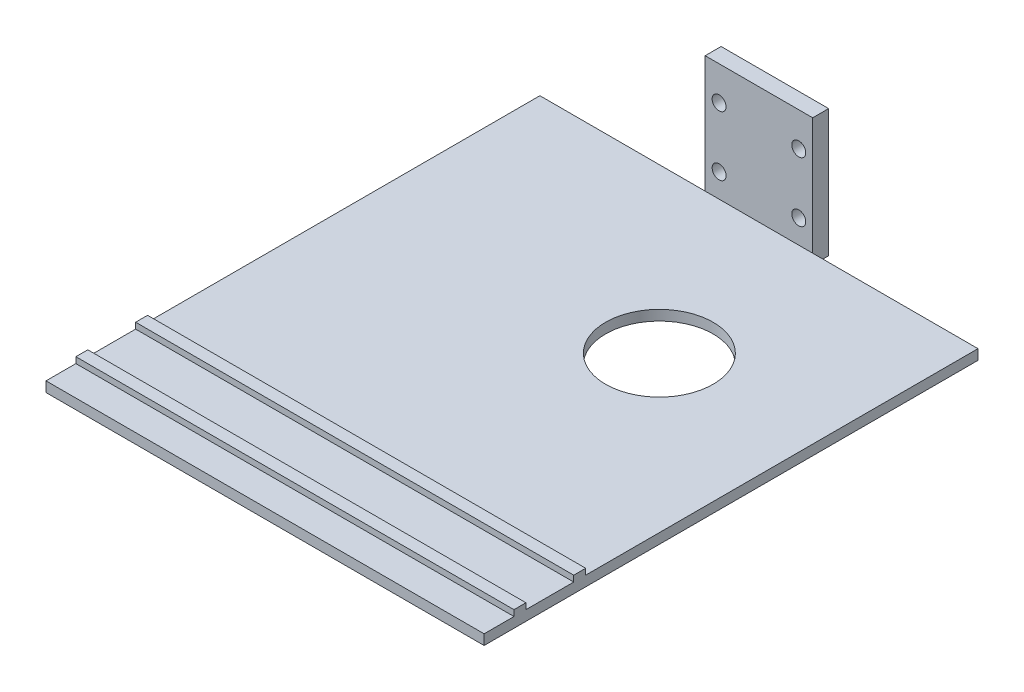
ISO-10303-21;
HEADER;
FILE_DESCRIPTION(('STEP AP214'),'2;1');
FILE_NAME('part.step','',(''),(''),'','','');
FILE_SCHEMA(('AUTOMOTIVE_DESIGN { 1 0 10303 214 1 1 1 1 }'));
ENDSEC;
DATA;
#1=APPLICATION_CONTEXT('core data for automotive mechanical design processes');
#2=APPLICATION_PROTOCOL_DEFINITION('international standard','automotive_design',2000,#1);
#3=PRODUCT_CONTEXT('',#1,'mechanical');
#4=PRODUCT('Part','Part','',(#3));
#5=PRODUCT_RELATED_PRODUCT_CATEGORY('part','',(#4));
#6=PRODUCT_DEFINITION_FORMATION('','',#4);
#7=PRODUCT_DEFINITION_CONTEXT('part definition',#1,'design');
#8=PRODUCT_DEFINITION('design','',#6,#7);
#9=PRODUCT_DEFINITION_SHAPE('','',#8);
#10=(LENGTH_UNIT() NAMED_UNIT(*) SI_UNIT(.MILLI.,.METRE.));
#11=(NAMED_UNIT(*) PLANE_ANGLE_UNIT() SI_UNIT($,.RADIAN.));
#12=(NAMED_UNIT(*) SI_UNIT($,.STERADIAN.) SOLID_ANGLE_UNIT());
#13=UNCERTAINTY_MEASURE_WITH_UNIT(LENGTH_MEASURE(1.E-05),#10,'distance_accuracy_value','');
#14=(GEOMETRIC_REPRESENTATION_CONTEXT(3) GLOBAL_UNCERTAINTY_ASSIGNED_CONTEXT((#13)) GLOBAL_UNIT_ASSIGNED_CONTEXT((#10,
#11,#12)) REPRESENTATION_CONTEXT('',''));
#15=CARTESIAN_POINT('',(0.,0.,0.));
#16=DIRECTION('',(0.,0.,1.));
#17=DIRECTION('',(1.,0.,0.));
#18=AXIS2_PLACEMENT_3D('',#15,#16,#17);
#19=CARTESIAN_POINT('',(-41.5,-33.4507406443201,4.));
#20=DIRECTION('',(0.,1.,0.));
#21=DIRECTION('',(0.,0.,1.));
#22=AXIS2_PLACEMENT_3D('',#19,#20,#21);
#23=PLANE('',#22);
#24=DIRECTION('',(-1.,0.,0.));
#25=VECTOR('',#24,1.);
#26=CARTESIAN_POINT('',(68.5,-33.4507406443201,117.5));
#27=LINE('',#26,#25);
#28=CARTESIAN_POINT('',(68.5,-33.4507406443201,117.5));
#29=VERTEX_POINT('',#28);
#30=CARTESIAN_POINT('',(-41.5,-33.4507406443201,117.5));
#31=VERTEX_POINT('',#30);
#32=EDGE_CURVE('E258',#29,#31,#27,.T.);
#33=ORIENTED_EDGE('',*,*,#32,.F.);
#34=DIRECTION('',(0.,0.,1.));
#35=VECTOR('',#34,1.);
#36=CARTESIAN_POINT('',(68.5,-33.45074064432,4.));
#37=LINE('',#36,#35);
#38=CARTESIAN_POINT('',(68.5,-33.4507406443201,105.5));
#39=VERTEX_POINT('',#38);
#40=EDGE_CURVE('E347',#39,#29,#37,.T.);
#41=ORIENTED_EDGE('',*,*,#40,.F.);
#42=DIRECTION('',(-1.,0.,0.));
#43=VECTOR('',#42,1.);
#44=CARTESIAN_POINT('',(68.5,-33.4507406443201,105.5));
#45=LINE('',#44,#43);
#46=CARTESIAN_POINT('',(-41.5,-33.4507406443201,105.5));
#47=VERTEX_POINT('',#46);
#48=EDGE_CURVE('E336',#39,#47,#45,.T.);
#49=ORIENTED_EDGE('',*,*,#48,.T.);
#50=DIRECTION('',(0.,0.,1.));
#51=VECTOR('',#50,1.);
#52=CARTESIAN_POINT('',(-41.5,-33.4507406443201,4.));
#53=LINE('',#52,#51);
#54=EDGE_CURVE('E269',#47,#31,#53,.T.);
#55=ORIENTED_EDGE('',*,*,#54,.T.);
#56=EDGE_LOOP('',(#33,#41,#49,#55));
#57=FACE_BOUND('',#56,.T.);
#58=ADVANCED_FACE('F33',(#57),#23,.T.);
#59=CARTESIAN_POINT('',(29.5,-33.4507406443201,45.));
#60=DIRECTION('',(0.,1.,0.));
#61=DIRECTION('',(0.,0.,1.));
#62=AXIS2_PLACEMENT_3D('',#59,#60,#61);
#63=CIRCLE('',#62,13.5);
#64=CARTESIAN_POINT('',(29.5,-33.4507406443201,58.5));
#65=VERTEX_POINT('',#64);
#66=EDGE_CURVE('E385',#65,#65,#63,.T.);
#67=ORIENTED_EDGE('',*,*,#66,.F.);
#68=EDGE_LOOP('',(#67));
#69=FACE_BOUND('',#68,.T.);
#70=DIRECTION('',(-1.,0.,0.));
#71=VECTOR('',#70,1.);
#72=CARTESIAN_POINT('',(68.5,-33.4507406443201,102.5));
#73=LINE('',#72,#71);
#74=CARTESIAN_POINT('',(68.5,-33.4507406443201,102.5));
#75=VERTEX_POINT('',#74);
#76=CARTESIAN_POINT('',(-41.5,-33.4507406443201,102.5));
#77=VERTEX_POINT('',#76);
#78=EDGE_CURVE('E339',#75,#77,#73,.T.);
#79=ORIENTED_EDGE('',*,*,#78,.F.);
#80=CARTESIAN_POINT('',(68.5,-33.45074064432,4.));
#81=VERTEX_POINT('',#80);
#82=EDGE_CURVE('E343',#81,#75,#37,.T.);
#83=ORIENTED_EDGE('',*,*,#82,.F.);
#84=DIRECTION('',(1.,0.,0.));
#85=VECTOR('',#84,1.);
#86=CARTESIAN_POINT('',(-41.5,-33.4507406443201,4.));
#87=LINE('',#86,#85);
#88=CARTESIAN_POINT('',(27.,-33.45074064432,4.));
#89=VERTEX_POINT('',#88);
#90=EDGE_CURVE('E45',#89,#81,#87,.T.);
#91=ORIENTED_EDGE('',*,*,#90,.F.);
#92=CARTESIAN_POINT('',(0.,-33.45074064432,4.));
#93=VERTEX_POINT('',#92);
#94=EDGE_CURVE('E11',#93,#89,#87,.T.);
#95=ORIENTED_EDGE('',*,*,#94,.F.);
#96=CARTESIAN_POINT('',(-41.5,-33.4507406443201,4.));
#97=VERTEX_POINT('',#96);
#98=EDGE_CURVE('E44',#97,#93,#87,.T.);
#99=ORIENTED_EDGE('',*,*,#98,.F.);
#100=EDGE_CURVE('E272',#97,#77,#53,.T.);
#101=ORIENTED_EDGE('',*,*,#100,.T.);
#102=EDGE_LOOP('',(#79,#83,#91,#95,#99,#101));
#103=FACE_BOUND('',#102,.T.);
#104=ADVANCED_FACE('F223',(#69,#103),#23,.T.);
#105=CARTESIAN_POINT('',(0.,0.,4.));
#106=DIRECTION('',(0.,0.,1.));
#107=DIRECTION('',(1.,0.,0.));
#108=AXIS2_PLACEMENT_3D('',#105,#106,#107);
#109=PLANE('',#108);
#110=DIRECTION('',(1.,0.,0.));
#111=VECTOR('',#110,1.);
#112=CARTESIAN_POINT('',(0.,-4.,4.));
#113=LINE('',#112,#111);
#114=CARTESIAN_POINT('',(0.,-4.,4.));
#115=VERTEX_POINT('',#114);
#116=CARTESIAN_POINT('',(27.,-4.,4.));
#117=VERTEX_POINT('',#116);
#118=EDGE_CURVE('E163',#115,#117,#113,.T.);
#119=ORIENTED_EDGE('',*,*,#118,.F.);
#120=DIRECTION('',(0.,-1.,0.));
#121=VECTOR('',#120,1.);
#122=CARTESIAN_POINT('',(0.,0.,4.));
#123=LINE('',#122,#121);
#124=EDGE_CURVE('E171',#115,#93,#123,.T.);
#125=ORIENTED_EDGE('',*,*,#124,.T.);
#126=ORIENTED_EDGE('',*,*,#94,.T.);
#127=DIRECTION('',(0.,1.,0.));
#128=VECTOR('',#127,1.);
#129=CARTESIAN_POINT('',(27.,0.,4.));
#130=LINE('',#129,#128);
#131=EDGE_CURVE('E304',#89,#117,#130,.T.);
#132=ORIENTED_EDGE('',*,*,#131,.T.);
#133=EDGE_LOOP('',(#119,#125,#126,#132));
#134=FACE_BOUND('',#133,.T.);
#135=CARTESIAN_POINT('',(23.5,-27.5,4.));
#136=DIRECTION('',(0.,0.,1.));
#137=DIRECTION('',(1.,0.,0.));
#138=AXIS2_PLACEMENT_3D('',#135,#136,#137);
#139=CIRCLE('',#138,1.75);
#140=CARTESIAN_POINT('',(25.25,-27.5,4.));
#141=VERTEX_POINT('',#140);
#142=EDGE_CURVE('E299',#141,#141,#139,.T.);
#143=ORIENTED_EDGE('',*,*,#142,.F.);
#144=EDGE_LOOP('',(#143));
#145=FACE_BOUND('',#144,.T.);
#146=CARTESIAN_POINT('',(3.5,-12.5,4.));
#147=DIRECTION('',(0.,0.,1.));
#148=DIRECTION('',(1.,0.,0.));
#149=AXIS2_PLACEMENT_3D('',#146,#147,#148);
#150=CIRCLE('',#149,1.75);
#151=CARTESIAN_POINT('',(5.25,-12.5,4.));
#152=VERTEX_POINT('',#151);
#153=EDGE_CURVE('E298',#152,#152,#150,.T.);
#154=ORIENTED_EDGE('',*,*,#153,.F.);
#155=EDGE_LOOP('',(#154));
#156=FACE_BOUND('',#155,.T.);
#157=CARTESIAN_POINT('',(3.5,-27.5,4.));
#158=DIRECTION('',(0.,0.,1.));
#159=DIRECTION('',(1.,0.,0.));
#160=AXIS2_PLACEMENT_3D('',#157,#158,#159);
#161=CIRCLE('',#160,1.75);
#162=CARTESIAN_POINT('',(5.25000000000001,-27.5,4.));
#163=VERTEX_POINT('',#162);
#164=EDGE_CURVE('E289',#163,#163,#161,.T.);
#165=ORIENTED_EDGE('',*,*,#164,.F.);
#166=EDGE_LOOP('',(#165));
#167=FACE_BOUND('',#166,.T.);
#168=CARTESIAN_POINT('',(23.5,-12.5,4.));
#169=DIRECTION('',(0.,0.,1.));
#170=DIRECTION('',(1.,0.,0.));
#171=AXIS2_PLACEMENT_3D('',#168,#169,#170);
#172=CIRCLE('',#171,1.75);
#173=CARTESIAN_POINT('',(25.25,-12.5,4.));
#174=VERTEX_POINT('',#173);
#175=EDGE_CURVE('E196',#174,#174,#172,.T.);
#176=ORIENTED_EDGE('',*,*,#175,.F.);
#177=EDGE_LOOP('',(#176));
#178=FACE_BOUND('',#177,.T.);
#179=ADVANCED_FACE('F230',(#134,#145,#156,#167,#178),#109,.T.);
#180=CARTESIAN_POINT('',(0.,0.,4.));
#181=DIRECTION('',(1.,0.,0.));
#182=DIRECTION('',(0.,1.,0.));
#183=AXIS2_PLACEMENT_3D('',#180,#181,#182);
#184=PLANE('',#183);
#185=ORIENTED_EDGE('',*,*,#124,.F.);
#186=DIRECTION('',(0.,0.,1.));
#187=VECTOR('',#186,1.);
#188=CARTESIAN_POINT('',(0.,-4.,0.));
#189=LINE('',#188,#187);
#190=CARTESIAN_POINT('',(0.,-4.,0.));
#191=VERTEX_POINT('',#190);
#192=EDGE_CURVE('E157',#191,#115,#189,.T.);
#193=ORIENTED_EDGE('',*,*,#192,.F.);
#194=DIRECTION('',(0.,-1.,0.));
#195=VECTOR('',#194,1.);
#196=CARTESIAN_POINT('',(0.,0.,0.));
#197=LINE('',#196,#195);
#198=CARTESIAN_POINT('',(0.,-36.,0.));
#199=VERTEX_POINT('',#198);
#200=EDGE_CURVE('E168',#191,#199,#197,.T.);
#201=ORIENTED_EDGE('',*,*,#200,.T.);
#202=DIRECTION('',(0.,0.,-1.));
#203=VECTOR('',#202,1.);
#204=CARTESIAN_POINT('',(0.,-36.,4.));
#205=LINE('',#204,#203);
#206=CARTESIAN_POINT('',(0.,-36.,4.));
#207=VERTEX_POINT('',#206);
#208=EDGE_CURVE('E42',#207,#199,#205,.T.);
#209=ORIENTED_EDGE('',*,*,#208,.F.);
#210=EDGE_CURVE('E187',#93,#207,#123,.T.);
#211=ORIENTED_EDGE('',*,*,#210,.F.);
#212=EDGE_LOOP('',(#185,#193,#201,#209,#211));
#213=FACE_BOUND('',#212,.T.);
#214=ADVANCED_FACE('F35',(#213),#184,.F.);
#215=CARTESIAN_POINT('',(0.,-36.,4.));
#216=DIRECTION('',(0.,1.,0.));
#217=DIRECTION('',(0.,0.,1.));
#218=AXIS2_PLACEMENT_3D('',#215,#216,#217);
#219=PLANE('',#218);
#220=CARTESIAN_POINT('',(29.5,-36.,45.));
#221=DIRECTION('',(0.,1.,0.));
#222=DIRECTION('',(0.,0.,1.));
#223=AXIS2_PLACEMENT_3D('',#220,#221,#222);
#224=CIRCLE('',#223,13.5);
#225=CARTESIAN_POINT('',(29.5,-36.,58.5));
#226=VERTEX_POINT('',#225);
#227=EDGE_CURVE('E37',#226,#226,#224,.T.);
#228=ORIENTED_EDGE('',*,*,#227,.T.);
#229=EDGE_LOOP('',(#228));
#230=FACE_BOUND('',#229,.T.);
#231=DIRECTION('',(1.,0.,0.));
#232=VECTOR('',#231,1.);
#233=CARTESIAN_POINT('',(0.,-36.,0.));
#234=LINE('',#233,#232);
#235=CARTESIAN_POINT('',(27.,-36.,0.));
#236=VERTEX_POINT('',#235);
#237=EDGE_CURVE('E174',#199,#236,#234,.T.);
#238=ORIENTED_EDGE('',*,*,#237,.T.);
#239=DIRECTION('',(0.,0.,-1.));
#240=VECTOR('',#239,1.);
#241=CARTESIAN_POINT('',(27.,-36.,4.));
#242=LINE('',#241,#240);
#243=CARTESIAN_POINT('',(27.,-36.,4.));
#244=VERTEX_POINT('',#243);
#245=EDGE_CURVE('E188',#244,#236,#242,.T.);
#246=ORIENTED_EDGE('',*,*,#245,.F.);
#247=DIRECTION('',(1.,0.,0.));
#248=VECTOR('',#247,1.);
#249=CARTESIAN_POINT('',(-41.5,-36.,4.));
#250=LINE('',#249,#248);
#251=CARTESIAN_POINT('',(68.5,-36.,4.));
#252=VERTEX_POINT('',#251);
#253=EDGE_CURVE('E290',#244,#252,#250,.T.);
#254=ORIENTED_EDGE('',*,*,#253,.T.);
#255=DIRECTION('',(0.,0.,-1.));
#256=VECTOR('',#255,1.);
#257=CARTESIAN_POINT('',(68.5,-36.,4.));
#258=LINE('',#257,#256);
#259=CARTESIAN_POINT('',(68.5,-36.,128.));
#260=VERTEX_POINT('',#259);
#261=EDGE_CURVE('E275',#260,#252,#258,.T.);
#262=ORIENTED_EDGE('',*,*,#261,.F.);
#263=DIRECTION('',(1.,0.,0.));
#264=VECTOR('',#263,1.);
#265=CARTESIAN_POINT('',(-41.5,-36.,128.));
#266=LINE('',#265,#264);
#267=CARTESIAN_POINT('',(-41.5,-36.,128.));
#268=VERTEX_POINT('',#267);
#269=EDGE_CURVE('E291',#268,#260,#266,.T.);
#270=ORIENTED_EDGE('',*,*,#269,.F.);
#271=DIRECTION('',(0.,0.,-1.));
#272=VECTOR('',#271,1.);
#273=CARTESIAN_POINT('',(-41.5,-36.,4.));
#274=LINE('',#273,#272);
#275=CARTESIAN_POINT('',(-41.5,-36.,4.));
#276=VERTEX_POINT('',#275);
#277=EDGE_CURVE('E282',#268,#276,#274,.T.);
#278=ORIENTED_EDGE('',*,*,#277,.T.);
#279=EDGE_CURVE('E286',#276,#207,#250,.T.);
#280=ORIENTED_EDGE('',*,*,#279,.T.);
#281=ORIENTED_EDGE('',*,*,#208,.T.);
#282=EDGE_LOOP('',(#238,#246,#254,#262,#270,#278,#280,#281));
#283=FACE_BOUND('',#282,.T.);
#284=ADVANCED_FACE('F310',(#230,#283),#219,.F.);
#285=CARTESIAN_POINT('',(27.,0.,4.));
#286=DIRECTION('',(-1.,0.,0.));
#287=DIRECTION('',(0.,-1.,0.));
#288=AXIS2_PLACEMENT_3D('',#285,#286,#287);
#289=PLANE('',#288);
#290=DIRECTION('',(0.,1.,0.));
#291=VECTOR('',#290,1.);
#292=CARTESIAN_POINT('',(27.,0.,0.));
#293=LINE('',#292,#291);
#294=CARTESIAN_POINT('',(27.,-4.,0.));
#295=VERTEX_POINT('',#294);
#296=EDGE_CURVE('E178',#236,#295,#293,.T.);
#297=ORIENTED_EDGE('',*,*,#296,.T.);
#298=DIRECTION('',(0.,0.,1.));
#299=VECTOR('',#298,1.);
#300=CARTESIAN_POINT('',(27.,-4.,0.));
#301=LINE('',#300,#299);
#302=EDGE_CURVE('E52',#295,#117,#301,.T.);
#303=ORIENTED_EDGE('',*,*,#302,.T.);
#304=ORIENTED_EDGE('',*,*,#131,.F.);
#305=EDGE_CURVE('E183',#244,#89,#130,.T.);
#306=ORIENTED_EDGE('',*,*,#305,.F.);
#307=ORIENTED_EDGE('',*,*,#245,.T.);
#308=EDGE_LOOP('',(#297,#303,#304,#306,#307));
#309=FACE_BOUND('',#308,.T.);
#310=ADVANCED_FACE('F477',(#309),#289,.F.);
#311=CARTESIAN_POINT('',(0.,0.,0.));
#312=DIRECTION('',(0.,0.,1.));
#313=DIRECTION('',(1.,0.,0.));
#314=AXIS2_PLACEMENT_3D('',#311,#312,#313);
#315=PLANE('',#314);
#316=CARTESIAN_POINT('',(23.5,-27.5,0.));
#317=DIRECTION('',(0.,0.,1.));
#318=DIRECTION('',(1.,0.,0.));
#319=AXIS2_PLACEMENT_3D('',#316,#317,#318);
#320=CIRCLE('',#319,1.75);
#321=CARTESIAN_POINT('',(25.25,-27.5,0.));
#322=VERTEX_POINT('',#321);
#323=EDGE_CURVE('E176',#322,#322,#320,.T.);
#324=ORIENTED_EDGE('',*,*,#323,.T.);
#325=EDGE_LOOP('',(#324));
#326=FACE_BOUND('',#325,.T.);
#327=CARTESIAN_POINT('',(3.5,-12.5,0.));
#328=DIRECTION('',(0.,0.,1.));
#329=DIRECTION('',(1.,0.,0.));
#330=AXIS2_PLACEMENT_3D('',#327,#328,#329);
#331=CIRCLE('',#330,1.75);
#332=CARTESIAN_POINT('',(5.25,-12.5,0.));
#333=VERTEX_POINT('',#332);
#334=EDGE_CURVE('E181',#333,#333,#331,.T.);
#335=ORIENTED_EDGE('',*,*,#334,.T.);
#336=EDGE_LOOP('',(#335));
#337=FACE_BOUND('',#336,.T.);
#338=CARTESIAN_POINT('',(3.5,-27.5,0.));
#339=DIRECTION('',(0.,0.,1.));
#340=DIRECTION('',(1.,0.,0.));
#341=AXIS2_PLACEMENT_3D('',#338,#339,#340);
#342=CIRCLE('',#341,1.75);
#343=CARTESIAN_POINT('',(5.25000000000001,-27.5,0.));
#344=VERTEX_POINT('',#343);
#345=EDGE_CURVE('E195',#344,#344,#342,.T.);
#346=ORIENTED_EDGE('',*,*,#345,.T.);
#347=EDGE_LOOP('',(#346));
#348=FACE_BOUND('',#347,.T.);
#349=CARTESIAN_POINT('',(23.5,-12.5,0.));
#350=DIRECTION('',(0.,0.,1.));
#351=DIRECTION('',(1.,0.,0.));
#352=AXIS2_PLACEMENT_3D('',#349,#350,#351);
#353=CIRCLE('',#352,1.75);
#354=CARTESIAN_POINT('',(25.25,-12.5,0.));
#355=VERTEX_POINT('',#354);
#356=EDGE_CURVE('E192',#355,#355,#353,.T.);
#357=ORIENTED_EDGE('',*,*,#356,.T.);
#358=EDGE_LOOP('',(#357));
#359=FACE_BOUND('',#358,.T.);
#360=ORIENTED_EDGE('',*,*,#200,.F.);
#361=DIRECTION('',(1.,0.,0.));
#362=VECTOR('',#361,1.);
#363=CARTESIAN_POINT('',(0.,-4.,0.));
#364=LINE('',#363,#362);
#365=EDGE_CURVE('E154',#191,#295,#364,.T.);
#366=ORIENTED_EDGE('',*,*,#365,.T.);
#367=ORIENTED_EDGE('',*,*,#296,.F.);
#368=ORIENTED_EDGE('',*,*,#237,.F.);
#369=EDGE_LOOP('',(#360,#366,#367,#368));
#370=FACE_BOUND('',#369,.T.);
#371=ADVANCED_FACE('F173',(#326,#337,#348,#359,#370),#315,.F.);
#372=CARTESIAN_POINT('',(23.5,-12.5,-6.));
#373=DIRECTION('',(0.,0.,1.));
#374=DIRECTION('',(1.,0.,0.));
#375=AXIS2_PLACEMENT_3D('',#372,#373,#374);
#376=CYLINDRICAL_SURFACE('',#375,1.75);
#377=ORIENTED_EDGE('',*,*,#175,.T.);
#378=EDGE_LOOP('',(#377));
#379=FACE_BOUND('',#378,.T.);
#380=ORIENTED_EDGE('',*,*,#356,.F.);
#381=EDGE_LOOP('',(#380));
#382=FACE_BOUND('',#381,.T.);
#383=ADVANCED_FACE('F217',(#379,#382),#376,.F.);
#384=CARTESIAN_POINT('',(3.5,-27.5,-6.));
#385=DIRECTION('',(0.,0.,1.));
#386=DIRECTION('',(1.,0.,0.));
#387=AXIS2_PLACEMENT_3D('',#384,#385,#386);
#388=CYLINDRICAL_SURFACE('',#387,1.75);
#389=ORIENTED_EDGE('',*,*,#164,.T.);
#390=EDGE_LOOP('',(#389));
#391=FACE_BOUND('',#390,.T.);
#392=ORIENTED_EDGE('',*,*,#345,.F.);
#393=EDGE_LOOP('',(#392));
#394=FACE_BOUND('',#393,.T.);
#395=ADVANCED_FACE('F207',(#391,#394),#388,.F.);
#396=CARTESIAN_POINT('',(3.5,-12.5,-6.));
#397=DIRECTION('',(0.,0.,1.));
#398=DIRECTION('',(1.,0.,0.));
#399=AXIS2_PLACEMENT_3D('',#396,#397,#398);
#400=CYLINDRICAL_SURFACE('',#399,1.75);
#401=ORIENTED_EDGE('',*,*,#153,.T.);
#402=EDGE_LOOP('',(#401));
#403=FACE_BOUND('',#402,.T.);
#404=ORIENTED_EDGE('',*,*,#334,.F.);
#405=EDGE_LOOP('',(#404));
#406=FACE_BOUND('',#405,.T.);
#407=ADVANCED_FACE('F204',(#403,#406),#400,.F.);
#408=CARTESIAN_POINT('',(23.5,-27.5,-6.));
#409=DIRECTION('',(0.,0.,1.));
#410=DIRECTION('',(1.,0.,0.));
#411=AXIS2_PLACEMENT_3D('',#408,#409,#410);
#412=CYLINDRICAL_SURFACE('',#411,1.75);
#413=ORIENTED_EDGE('',*,*,#142,.T.);
#414=EDGE_LOOP('',(#413));
#415=FACE_BOUND('',#414,.T.);
#416=ORIENTED_EDGE('',*,*,#323,.F.);
#417=EDGE_LOOP('',(#416));
#418=FACE_BOUND('',#417,.T.);
#419=ADVANCED_FACE('F206',(#415,#418),#412,.F.);
#420=CARTESIAN_POINT('',(-41.5,-36.,4.));
#421=DIRECTION('',(0.,0.,-1.));
#422=DIRECTION('',(-1.,0.,0.));
#423=AXIS2_PLACEMENT_3D('',#420,#421,#422);
#424=PLANE('',#423);
#425=ORIENTED_EDGE('',*,*,#98,.T.);
#426=ORIENTED_EDGE('',*,*,#210,.T.);
#427=ORIENTED_EDGE('',*,*,#279,.F.);
#428=DIRECTION('',(0.,1.,0.));
#429=VECTOR('',#428,1.);
#430=CARTESIAN_POINT('',(-41.5,-36.,4.));
#431=LINE('',#430,#429);
#432=EDGE_CURVE('E270',#276,#97,#431,.T.);
#433=ORIENTED_EDGE('',*,*,#432,.T.);
#434=EDGE_LOOP('',(#425,#426,#427,#433));
#435=FACE_BOUND('',#434,.T.);
#436=ADVANCED_FACE('F214',(#435),#424,.T.);
#437=ORIENTED_EDGE('',*,*,#253,.F.);
#438=ORIENTED_EDGE('',*,*,#305,.T.);
#439=ORIENTED_EDGE('',*,*,#90,.T.);
#440=DIRECTION('',(0.,1.,0.));
#441=VECTOR('',#440,1.);
#442=CARTESIAN_POINT('',(68.5,-36.,4.));
#443=LINE('',#442,#441);
#444=EDGE_CURVE('E333',#252,#81,#443,.T.);
#445=ORIENTED_EDGE('',*,*,#444,.F.);
#446=EDGE_LOOP('',(#437,#438,#439,#445));
#447=FACE_BOUND('',#446,.T.);
#448=ADVANCED_FACE('F246',(#447),#424,.T.);
#449=CARTESIAN_POINT('',(-41.5,-36.,128.));
#450=DIRECTION('',(0.,0.,1.));
#451=DIRECTION('',(1.,0.,0.));
#452=AXIS2_PLACEMENT_3D('',#449,#450,#451);
#453=PLANE('',#452);
#454=ORIENTED_EDGE('',*,*,#269,.T.);
#455=DIRECTION('',(0.,-1.,0.));
#456=VECTOR('',#455,1.);
#457=CARTESIAN_POINT('',(68.5,-36.,128.));
#458=LINE('',#457,#456);
#459=CARTESIAN_POINT('',(68.5,-33.4507406443201,128.));
#460=VERTEX_POINT('',#459);
#461=EDGE_CURVE('E346',#460,#260,#458,.T.);
#462=ORIENTED_EDGE('',*,*,#461,.F.);
#463=DIRECTION('',(1.,0.,0.));
#464=VECTOR('',#463,1.);
#465=CARTESIAN_POINT('',(-41.5,-33.4507406443201,128.));
#466=LINE('',#465,#464);
#467=CARTESIAN_POINT('',(-41.5,-33.4507406443201,128.));
#468=VERTEX_POINT('',#467);
#469=EDGE_CURVE('E293',#468,#460,#466,.T.);
#470=ORIENTED_EDGE('',*,*,#469,.F.);
#471=DIRECTION('',(0.,-1.,0.));
#472=VECTOR('',#471,1.);
#473=CARTESIAN_POINT('',(-41.5,-36.,128.));
#474=LINE('',#473,#472);
#475=EDGE_CURVE('E268',#468,#268,#474,.T.);
#476=ORIENTED_EDGE('',*,*,#475,.T.);
#477=EDGE_LOOP('',(#454,#462,#470,#476));
#478=FACE_BOUND('',#477,.T.);
#479=ADVANCED_FACE('F237',(#478),#453,.T.);
#480=DIRECTION('',(-1.,0.,0.));
#481=VECTOR('',#480,1.);
#482=CARTESIAN_POINT('',(68.5,-33.4507406443201,120.5));
#483=LINE('',#482,#481);
#484=CARTESIAN_POINT('',(68.5,-33.4507406443201,120.5));
#485=VERTEX_POINT('',#484);
#486=CARTESIAN_POINT('',(-41.5,-33.4507406443201,120.5));
#487=VERTEX_POINT('',#486);
#488=EDGE_CURVE('E250',#485,#487,#483,.T.);
#489=ORIENTED_EDGE('',*,*,#488,.T.);
#490=EDGE_CURVE('E253',#487,#468,#53,.T.);
#491=ORIENTED_EDGE('',*,*,#490,.T.);
#492=ORIENTED_EDGE('',*,*,#469,.T.);
#493=EDGE_CURVE('E255',#485,#460,#37,.T.);
#494=ORIENTED_EDGE('',*,*,#493,.F.);
#495=EDGE_LOOP('',(#489,#491,#492,#494));
#496=FACE_BOUND('',#495,.T.);
#497=ADVANCED_FACE('F226',(#496),#23,.T.);
#498=CARTESIAN_POINT('',(-41.5,0.,0.));
#499=DIRECTION('',(1.,0.,0.));
#500=DIRECTION('',(0.,0.,-1.));
#501=AXIS2_PLACEMENT_3D('',#498,#499,#500);
#502=PLANE('',#501);
#503=ORIENTED_EDGE('',*,*,#432,.F.);
#504=ORIENTED_EDGE('',*,*,#277,.F.);
#505=ORIENTED_EDGE('',*,*,#475,.F.);
#506=ORIENTED_EDGE('',*,*,#490,.F.);
#507=DIRECTION('',(0.,1.,0.));
#508=VECTOR('',#507,1.);
#509=CARTESIAN_POINT('',(-41.5,-33.4507406443201,120.5));
#510=LINE('',#509,#508);
#511=CARTESIAN_POINT('',(-41.5,-31.95074064432,120.5));
#512=VERTEX_POINT('',#511);
#513=EDGE_CURVE('E264',#487,#512,#510,.T.);
#514=ORIENTED_EDGE('',*,*,#513,.T.);
#515=DIRECTION('',(0.,0.,-1.));
#516=VECTOR('',#515,1.);
#517=CARTESIAN_POINT('',(-41.5,-31.95074064432,117.5));
#518=LINE('',#517,#516);
#519=CARTESIAN_POINT('',(-41.5,-31.95074064432,117.5));
#520=VERTEX_POINT('',#519);
#521=EDGE_CURVE('E372',#512,#520,#518,.T.);
#522=ORIENTED_EDGE('',*,*,#521,.T.);
#523=DIRECTION('',(0.,-1.,0.));
#524=VECTOR('',#523,1.);
#525=CARTESIAN_POINT('',(-41.5,-33.4507406443201,117.5));
#526=LINE('',#525,#524);
#527=EDGE_CURVE('E376',#520,#31,#526,.T.);
#528=ORIENTED_EDGE('',*,*,#527,.T.);
#529=ORIENTED_EDGE('',*,*,#54,.F.);
#530=DIRECTION('',(0.,1.,0.));
#531=VECTOR('',#530,1.);
#532=CARTESIAN_POINT('',(-41.5,-33.4507406443201,105.5));
#533=LINE('',#532,#531);
#534=CARTESIAN_POINT('',(-41.5,-31.95074064432,105.5));
#535=VERTEX_POINT('',#534);
#536=EDGE_CURVE('E320',#47,#535,#533,.T.);
#537=ORIENTED_EDGE('',*,*,#536,.T.);
#538=DIRECTION('',(0.,0.,-1.));
#539=VECTOR('',#538,1.);
#540=CARTESIAN_POINT('',(-41.5,-31.95074064432,102.5));
#541=LINE('',#540,#539);
#542=CARTESIAN_POINT('',(-41.5,-31.95074064432,102.5));
#543=VERTEX_POINT('',#542);
#544=EDGE_CURVE('E318',#535,#543,#541,.T.);
#545=ORIENTED_EDGE('',*,*,#544,.T.);
#546=DIRECTION('',(0.,-1.,0.));
#547=VECTOR('',#546,1.);
#548=CARTESIAN_POINT('',(-41.5,-33.4507406443201,102.5));
#549=LINE('',#548,#547);
#550=EDGE_CURVE('E315',#543,#77,#549,.T.);
#551=ORIENTED_EDGE('',*,*,#550,.T.);
#552=ORIENTED_EDGE('',*,*,#100,.F.);
#553=EDGE_LOOP('',(#503,#504,#505,#506,#514,#522,#528,#529,#537,#545,#551,#552));
#554=FACE_BOUND('',#553,.T.);
#555=ADVANCED_FACE('F236',(#554),#502,.F.);
#556=CARTESIAN_POINT('',(68.5,0.,0.));
#557=DIRECTION('',(1.,0.,0.));
#558=DIRECTION('',(0.,0.,-1.));
#559=AXIS2_PLACEMENT_3D('',#556,#557,#558);
#560=PLANE('',#559);
#561=ORIENTED_EDGE('',*,*,#444,.T.);
#562=ORIENTED_EDGE('',*,*,#82,.T.);
#563=DIRECTION('',(0.,-1.,0.));
#564=VECTOR('',#563,1.);
#565=CARTESIAN_POINT('',(68.5,-33.4507406443201,102.5));
#566=LINE('',#565,#564);
#567=CARTESIAN_POINT('',(68.5,-31.95074064432,102.5));
#568=VERTEX_POINT('',#567);
#569=EDGE_CURVE('E330',#568,#75,#566,.T.);
#570=ORIENTED_EDGE('',*,*,#569,.F.);
#571=DIRECTION('',(0.,0.,-1.));
#572=VECTOR('',#571,1.);
#573=CARTESIAN_POINT('',(68.5,-31.95074064432,102.5));
#574=LINE('',#573,#572);
#575=CARTESIAN_POINT('',(68.5,-31.95074064432,105.5));
#576=VERTEX_POINT('',#575);
#577=EDGE_CURVE('E326',#576,#568,#574,.T.);
#578=ORIENTED_EDGE('',*,*,#577,.F.);
#579=DIRECTION('',(0.,1.,0.));
#580=VECTOR('',#579,1.);
#581=CARTESIAN_POINT('',(68.5,-33.4507406443201,105.5));
#582=LINE('',#581,#580);
#583=EDGE_CURVE('E361',#39,#576,#582,.T.);
#584=ORIENTED_EDGE('',*,*,#583,.F.);
#585=ORIENTED_EDGE('',*,*,#40,.T.);
#586=DIRECTION('',(0.,-1.,0.));
#587=VECTOR('',#586,1.);
#588=CARTESIAN_POINT('',(68.5,-33.4507406443201,117.5));
#589=LINE('',#588,#587);
#590=CARTESIAN_POINT('',(68.5,-31.95074064432,117.5));
#591=VERTEX_POINT('',#590);
#592=EDGE_CURVE('E374',#591,#29,#589,.T.);
#593=ORIENTED_EDGE('',*,*,#592,.F.);
#594=DIRECTION('',(0.,0.,-1.));
#595=VECTOR('',#594,1.);
#596=CARTESIAN_POINT('',(68.5,-31.95074064432,117.5));
#597=LINE('',#596,#595);
#598=CARTESIAN_POINT('',(68.5,-31.95074064432,120.5));
#599=VERTEX_POINT('',#598);
#600=EDGE_CURVE('E369',#599,#591,#597,.T.);
#601=ORIENTED_EDGE('',*,*,#600,.F.);
#602=DIRECTION('',(0.,1.,0.));
#603=VECTOR('',#602,1.);
#604=CARTESIAN_POINT('',(68.5,-33.4507406443201,120.5));
#605=LINE('',#604,#603);
#606=EDGE_CURVE('E60',#485,#599,#605,.T.);
#607=ORIENTED_EDGE('',*,*,#606,.F.);
#608=ORIENTED_EDGE('',*,*,#493,.T.);
#609=ORIENTED_EDGE('',*,*,#461,.T.);
#610=ORIENTED_EDGE('',*,*,#261,.T.);
#611=EDGE_LOOP('',(#561,#562,#570,#578,#584,#585,#593,#601,#607,#608,#609,#610));
#612=FACE_BOUND('',#611,.T.);
#613=ADVANCED_FACE('F243',(#612),#560,.T.);
#614=CARTESIAN_POINT('',(68.5,-33.4507406443201,102.5));
#615=DIRECTION('',(0.,0.,-1.));
#616=DIRECTION('',(-1.,0.,0.));
#617=AXIS2_PLACEMENT_3D('',#614,#615,#616);
#618=PLANE('',#617);
#619=ORIENTED_EDGE('',*,*,#550,.F.);
#620=DIRECTION('',(-1.,0.,0.));
#621=VECTOR('',#620,1.);
#622=CARTESIAN_POINT('',(68.5,-31.95074064432,102.5));
#623=LINE('',#622,#621);
#624=EDGE_CURVE('E331',#568,#543,#623,.T.);
#625=ORIENTED_EDGE('',*,*,#624,.F.);
#626=ORIENTED_EDGE('',*,*,#569,.T.);
#627=ORIENTED_EDGE('',*,*,#78,.T.);
#628=EDGE_LOOP('',(#619,#625,#626,#627));
#629=FACE_BOUND('',#628,.T.);
#630=ADVANCED_FACE('F415',(#629),#618,.T.);
#631=CARTESIAN_POINT('',(68.5,-31.95074064432,102.5));
#632=DIRECTION('',(0.,1.,0.));
#633=DIRECTION('',(0.,0.,1.));
#634=AXIS2_PLACEMENT_3D('',#631,#632,#633);
#635=PLANE('',#634);
#636=ORIENTED_EDGE('',*,*,#544,.F.);
#637=DIRECTION('',(-1.,0.,0.));
#638=VECTOR('',#637,1.);
#639=CARTESIAN_POINT('',(68.5,-31.95074064432,105.5));
#640=LINE('',#639,#638);
#641=EDGE_CURVE('E334',#576,#535,#640,.T.);
#642=ORIENTED_EDGE('',*,*,#641,.F.);
#643=ORIENTED_EDGE('',*,*,#577,.T.);
#644=ORIENTED_EDGE('',*,*,#624,.T.);
#645=EDGE_LOOP('',(#636,#642,#643,#644));
#646=FACE_BOUND('',#645,.T.);
#647=ADVANCED_FACE('F364',(#646),#635,.T.);
#648=CARTESIAN_POINT('',(68.5,-33.4507406443201,105.5));
#649=DIRECTION('',(0.,0.,1.));
#650=DIRECTION('',(1.,0.,0.));
#651=AXIS2_PLACEMENT_3D('',#648,#649,#650);
#652=PLANE('',#651);
#653=ORIENTED_EDGE('',*,*,#536,.F.);
#654=ORIENTED_EDGE('',*,*,#48,.F.);
#655=ORIENTED_EDGE('',*,*,#583,.T.);
#656=ORIENTED_EDGE('',*,*,#641,.T.);
#657=EDGE_LOOP('',(#653,#654,#655,#656));
#658=FACE_BOUND('',#657,.T.);
#659=ADVANCED_FACE('F411',(#658),#652,.T.);
#660=CARTESIAN_POINT('',(68.5,-33.4507406443201,117.5));
#661=DIRECTION('',(0.,0.,-1.));
#662=DIRECTION('',(-1.,0.,0.));
#663=AXIS2_PLACEMENT_3D('',#660,#661,#662);
#664=PLANE('',#663);
#665=ORIENTED_EDGE('',*,*,#527,.F.);
#666=DIRECTION('',(-1.,0.,0.));
#667=VECTOR('',#666,1.);
#668=CARTESIAN_POINT('',(68.5,-31.95074064432,117.5));
#669=LINE('',#668,#667);
#670=EDGE_CURVE('E321',#591,#520,#669,.T.);
#671=ORIENTED_EDGE('',*,*,#670,.F.);
#672=ORIENTED_EDGE('',*,*,#592,.T.);
#673=ORIENTED_EDGE('',*,*,#32,.T.);
#674=EDGE_LOOP('',(#665,#671,#672,#673));
#675=FACE_BOUND('',#674,.T.);
#676=ADVANCED_FACE('F405',(#675),#664,.T.);
#677=CARTESIAN_POINT('',(68.5,-31.95074064432,117.5));
#678=DIRECTION('',(0.,1.,0.));
#679=DIRECTION('',(0.,0.,1.));
#680=AXIS2_PLACEMENT_3D('',#677,#678,#679);
#681=PLANE('',#680);
#682=ORIENTED_EDGE('',*,*,#521,.F.);
#683=DIRECTION('',(-1.,0.,0.));
#684=VECTOR('',#683,1.);
#685=CARTESIAN_POINT('',(68.5,-31.95074064432,120.5));
#686=LINE('',#685,#684);
#687=EDGE_CURVE('E257',#599,#512,#686,.T.);
#688=ORIENTED_EDGE('',*,*,#687,.F.);
#689=ORIENTED_EDGE('',*,*,#600,.T.);
#690=ORIENTED_EDGE('',*,*,#670,.T.);
#691=EDGE_LOOP('',(#682,#688,#689,#690));
#692=FACE_BOUND('',#691,.T.);
#693=ADVANCED_FACE('F402',(#692),#681,.T.);
#694=CARTESIAN_POINT('',(68.5,-33.4507406443201,120.5));
#695=DIRECTION('',(0.,0.,1.));
#696=DIRECTION('',(1.,0.,0.));
#697=AXIS2_PLACEMENT_3D('',#694,#695,#696);
#698=PLANE('',#697);
#699=ORIENTED_EDGE('',*,*,#513,.F.);
#700=ORIENTED_EDGE('',*,*,#488,.F.);
#701=ORIENTED_EDGE('',*,*,#606,.T.);
#702=ORIENTED_EDGE('',*,*,#687,.T.);
#703=EDGE_LOOP('',(#699,#700,#701,#702));
#704=FACE_BOUND('',#703,.T.);
#705=ADVANCED_FACE('F399',(#704),#698,.T.);
#706=CARTESIAN_POINT('',(0.,-4.,0.));
#707=DIRECTION('',(0.,-1.,0.));
#708=DIRECTION('',(0.,0.,-1.));
#709=AXIS2_PLACEMENT_3D('',#706,#707,#708);
#710=PLANE('',#709);
#711=ORIENTED_EDGE('',*,*,#118,.T.);
#712=ORIENTED_EDGE('',*,*,#302,.F.);
#713=ORIENTED_EDGE('',*,*,#365,.F.);
#714=ORIENTED_EDGE('',*,*,#192,.T.);
#715=EDGE_LOOP('',(#711,#712,#713,#714));
#716=FACE_BOUND('',#715,.T.);
#717=ADVANCED_FACE('F156',(#716),#710,.F.);
#718=CARTESIAN_POINT('',(29.5,-43.4507406443201,45.));
#719=DIRECTION('',(0.,1.,0.));
#720=DIRECTION('',(0.,0.,1.));
#721=AXIS2_PLACEMENT_3D('',#718,#719,#720);
#722=CYLINDRICAL_SURFACE('',#721,13.5);
#723=ORIENTED_EDGE('',*,*,#66,.T.);
#724=EDGE_LOOP('',(#723));
#725=FACE_BOUND('',#724,.T.);
#726=ORIENTED_EDGE('',*,*,#227,.F.);
#727=EDGE_LOOP('',(#726));
#728=FACE_BOUND('',#727,.T.);
#729=ADVANCED_FACE('F393',(#725,#728),#722,.F.);
#730=CLOSED_SHELL('',(#58,#104,#179,#214,#284,#310,#371,#383,#395,#407,#419,#436,#448,#479,#497,
#555,#613,#630,#647,#659,#676,#693,#705,#717,#729));
#731=MANIFOLD_SOLID_BREP('B2',#730);
#732=ADVANCED_BREP_SHAPE_REPRESENTATION('',(#18,#731),#14);
#733=SHAPE_DEFINITION_REPRESENTATION(#9,#732);
ENDSEC;
END-ISO-10303-21;
